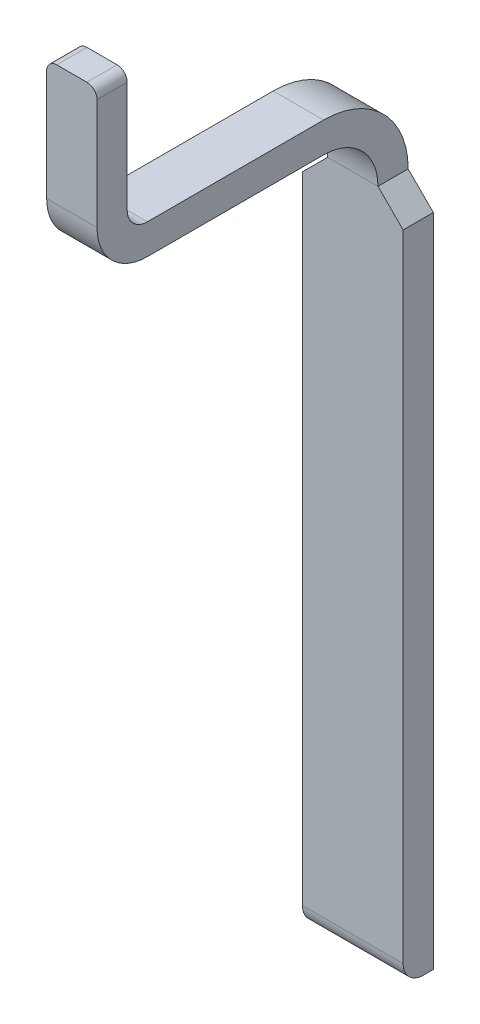
ISO-10303-21;
HEADER;
FILE_DESCRIPTION(('STEP AP214'),'2;1');
FILE_NAME('part.step','',(''),(''),'','','');
FILE_SCHEMA(('AUTOMOTIVE_DESIGN { 1 0 10303 214 1 1 1 1 }'));
ENDSEC;
DATA;
#1=APPLICATION_CONTEXT('core data for automotive mechanical design processes');
#2=APPLICATION_PROTOCOL_DEFINITION('international standard','automotive_design',2000,#1);
#3=PRODUCT_CONTEXT('',#1,'mechanical');
#4=PRODUCT('Part','Part','',(#3));
#5=PRODUCT_RELATED_PRODUCT_CATEGORY('part','',(#4));
#6=PRODUCT_DEFINITION_FORMATION('','',#4);
#7=PRODUCT_DEFINITION_CONTEXT('part definition',#1,'design');
#8=PRODUCT_DEFINITION('design','',#6,#7);
#9=PRODUCT_DEFINITION_SHAPE('','',#8);
#10=(LENGTH_UNIT() NAMED_UNIT(*) SI_UNIT(.MILLI.,.METRE.));
#11=(NAMED_UNIT(*) PLANE_ANGLE_UNIT() SI_UNIT($,.RADIAN.));
#12=(NAMED_UNIT(*) SI_UNIT($,.STERADIAN.) SOLID_ANGLE_UNIT());
#13=UNCERTAINTY_MEASURE_WITH_UNIT(LENGTH_MEASURE(1.E-05),#10,'distance_accuracy_value','');
#14=(GEOMETRIC_REPRESENTATION_CONTEXT(3) GLOBAL_UNCERTAINTY_ASSIGNED_CONTEXT((#13)) GLOBAL_UNIT_ASSIGNED_CONTEXT((#10,
#11,#12)) REPRESENTATION_CONTEXT('',''));
#15=CARTESIAN_POINT('',(0.,0.,0.));
#16=DIRECTION('',(0.,0.,1.));
#17=DIRECTION('',(1.,0.,0.));
#18=AXIS2_PLACEMENT_3D('',#15,#16,#17);
#19=CARTESIAN_POINT('',(1.55,2.03,-0.12));
#20=DIRECTION('',(0.,0.,-1.));
#21=DIRECTION('',(-1.,0.,0.));
#22=AXIS2_PLACEMENT_3D('',#19,#20,#21);
#23=PLANE('',#22);
#24=DIRECTION('',(0.,-1.,0.));
#25=VECTOR('',#24,1.);
#26=CARTESIAN_POINT('',(1.05,2.03,-0.12));
#27=LINE('',#26,#25);
#28=CARTESIAN_POINT('',(1.05,1.905,-0.12));
#29=VERTEX_POINT('',#28);
#30=CARTESIAN_POINT('',(1.05,-1.25,-0.12));
#31=VERTEX_POINT('',#30);
#32=EDGE_CURVE('E10',#29,#31,#27,.T.);
#33=ORIENTED_EDGE('',*,*,#32,.T.);
#34=DIRECTION('',(1.,0.,0.));
#35=VECTOR('',#34,1.);
#36=CARTESIAN_POINT('',(1.55,-1.25,-0.12));
#37=LINE('',#36,#35);
#38=CARTESIAN_POINT('',(1.55,-1.25,-0.12));
#39=VERTEX_POINT('',#38);
#40=EDGE_CURVE('E203',#31,#39,#37,.T.);
#41=ORIENTED_EDGE('',*,*,#40,.T.);
#42=DIRECTION('',(0.,-1.,0.));
#43=VECTOR('',#42,1.);
#44=CARTESIAN_POINT('',(1.55,2.03,-0.12));
#45=LINE('',#44,#43);
#46=CARTESIAN_POINT('',(1.55,1.905,-0.12));
#47=VERTEX_POINT('',#46);
#48=EDGE_CURVE('E26',#47,#39,#45,.T.);
#49=ORIENTED_EDGE('',*,*,#48,.F.);
#50=DIRECTION('',(-0.707106781186547,0.707106781186548,0.));
#51=VECTOR('',#50,1.);
#52=CARTESIAN_POINT('',(1.55,1.905,-0.12));
#53=LINE('',#52,#51);
#54=CARTESIAN_POINT('',(1.425,2.03,-0.12));
#55=VERTEX_POINT('',#54);
#56=EDGE_CURVE('E232',#47,#55,#53,.T.);
#57=ORIENTED_EDGE('',*,*,#56,.T.);
#58=DIRECTION('',(-1.,0.,0.));
#59=VECTOR('',#58,1.);
#60=CARTESIAN_POINT('',(1.55,2.03,-0.12));
#61=LINE('',#60,#59);
#62=CARTESIAN_POINT('',(1.175,2.03,-0.12));
#63=VERTEX_POINT('',#62);
#64=EDGE_CURVE('E292',#55,#63,#61,.T.);
#65=ORIENTED_EDGE('',*,*,#64,.T.);
#66=DIRECTION('',(-0.707106781186547,-0.707106781186548,0.));
#67=VECTOR('',#66,1.);
#68=CARTESIAN_POINT('',(1.175,2.03,-0.12));
#69=LINE('',#68,#67);
#70=EDGE_CURVE('E262',#63,#29,#69,.T.);
#71=ORIENTED_EDGE('',*,*,#70,.T.);
#72=EDGE_LOOP('',(#33,#41,#49,#57,#65,#71));
#73=FACE_BOUND('',#72,.T.);
#74=ADVANCED_FACE('F15',(#73),#23,.F.);
#75=CARTESIAN_POINT('',(1.05,-1.35,-0.27));
#76=DIRECTION('',(1.,0.,0.));
#77=DIRECTION('',(0.,-1.,0.));
#78=AXIS2_PLACEMENT_3D('',#75,#76,#77);
#79=PLANE('',#78);
#80=DIRECTION('',(0.,0.,-1.));
#81=VECTOR('',#80,1.);
#82=CARTESIAN_POINT('',(1.05,-1.35,-0.12));
#83=LINE('',#82,#81);
#84=CARTESIAN_POINT('',(1.05,-1.35,-0.22));
#85=VERTEX_POINT('',#84);
#86=CARTESIAN_POINT('',(1.05,-1.35,-0.27));
#87=VERTEX_POINT('',#86);
#88=EDGE_CURVE('E226',#85,#87,#83,.T.);
#89=ORIENTED_EDGE('',*,*,#88,.F.);
#90=CARTESIAN_POINT('',(1.05,-1.25,-0.22));
#91=DIRECTION('',(-1.,0.,0.));
#92=DIRECTION('',(0.,1.,0.));
#93=AXIS2_PLACEMENT_3D('',#90,#91,#92);
#94=CIRCLE('',#93,0.1);
#95=EDGE_CURVE('E280',#85,#31,#94,.T.);
#96=ORIENTED_EDGE('',*,*,#95,.T.);
#97=ORIENTED_EDGE('',*,*,#32,.F.);
#98=DIRECTION('',(0.,0.,-1.));
#99=VECTOR('',#98,1.);
#100=CARTESIAN_POINT('',(1.05,1.905,-0.27));
#101=LINE('',#100,#99);
#102=CARTESIAN_POINT('',(1.05,1.905,-0.27));
#103=VERTEX_POINT('',#102);
#104=EDGE_CURVE('E259',#29,#103,#101,.T.);
#105=ORIENTED_EDGE('',*,*,#104,.T.);
#106=DIRECTION('',(0.,1.,0.));
#107=VECTOR('',#106,1.);
#108=CARTESIAN_POINT('',(1.05,-1.35,-0.27));
#109=LINE('',#108,#107);
#110=EDGE_CURVE('E225',#87,#103,#109,.T.);
#111=ORIENTED_EDGE('',*,*,#110,.F.);
#112=EDGE_LOOP('',(#89,#96,#97,#105,#111));
#113=FACE_BOUND('',#112,.T.);
#114=ADVANCED_FACE('F357',(#113),#79,.F.);
#115=CARTESIAN_POINT('',(1.55,-1.35,-0.27));
#116=DIRECTION('',(1.,0.,0.));
#117=DIRECTION('',(0.,-1.,0.));
#118=AXIS2_PLACEMENT_3D('',#115,#116,#117);
#119=PLANE('',#118);
#120=ORIENTED_EDGE('',*,*,#48,.T.);
#121=CARTESIAN_POINT('',(1.55,-1.25,-0.22));
#122=DIRECTION('',(1.,0.,0.));
#123=DIRECTION('',(0.,1.,0.));
#124=AXIS2_PLACEMENT_3D('',#121,#122,#123);
#125=CIRCLE('',#124,0.1);
#126=CARTESIAN_POINT('',(1.55,-1.35,-0.22));
#127=VERTEX_POINT('',#126);
#128=EDGE_CURVE('E199',#39,#127,#125,.T.);
#129=ORIENTED_EDGE('',*,*,#128,.T.);
#130=DIRECTION('',(0.,0.,-1.));
#131=VECTOR('',#130,1.);
#132=CARTESIAN_POINT('',(1.55,-1.35,-0.12));
#133=LINE('',#132,#131);
#134=CARTESIAN_POINT('',(1.55,-1.35,-0.27));
#135=VERTEX_POINT('',#134);
#136=EDGE_CURVE('E218',#127,#135,#133,.T.);
#137=ORIENTED_EDGE('',*,*,#136,.T.);
#138=DIRECTION('',(0.,1.,0.));
#139=VECTOR('',#138,1.);
#140=CARTESIAN_POINT('',(1.55,-1.35,-0.27));
#141=LINE('',#140,#139);
#142=CARTESIAN_POINT('',(1.55,1.905,-0.27));
#143=VERTEX_POINT('',#142);
#144=EDGE_CURVE('E263',#135,#143,#141,.T.);
#145=ORIENTED_EDGE('',*,*,#144,.T.);
#146=DIRECTION('',(0.,0.,1.));
#147=VECTOR('',#146,1.);
#148=CARTESIAN_POINT('',(1.55,1.905,-0.12));
#149=LINE('',#148,#147);
#150=EDGE_CURVE('E227',#143,#47,#149,.T.);
#151=ORIENTED_EDGE('',*,*,#150,.T.);
#152=EDGE_LOOP('',(#120,#129,#137,#145,#151));
#153=FACE_BOUND('',#152,.T.);
#154=ADVANCED_FACE('F398',(#153),#119,.T.);
#155=CARTESIAN_POINT('',(1.425,2.03,0.15));
#156=DIRECTION('',(1.,0.,0.));
#157=DIRECTION('',(0.,0.,1.));
#158=AXIS2_PLACEMENT_3D('',#155,#156,#157);
#159=CYLINDRICAL_SURFACE('',#158,0.27);
#160=CARTESIAN_POINT('',(1.175,2.03,0.15));
#161=DIRECTION('',(1.,0.,0.));
#162=DIRECTION('',(0.,-1.,0.));
#163=AXIS2_PLACEMENT_3D('',#160,#161,#162);
#164=CIRCLE('',#163,0.27);
#165=CARTESIAN_POINT('',(1.175,2.3,0.15));
#166=VERTEX_POINT('',#165);
#167=EDGE_CURVE('E209',#63,#166,#164,.T.);
#168=ORIENTED_EDGE('',*,*,#167,.F.);
#169=ORIENTED_EDGE('',*,*,#64,.F.);
#170=CARTESIAN_POINT('',(1.425,2.03,0.15));
#171=DIRECTION('',(1.,0.,0.));
#172=DIRECTION('',(0.,-1.,0.));
#173=AXIS2_PLACEMENT_3D('',#170,#171,#172);
#174=CIRCLE('',#173,0.27);
#175=CARTESIAN_POINT('',(1.425,2.3,0.15));
#176=VERTEX_POINT('',#175);
#177=EDGE_CURVE('E236',#55,#176,#174,.T.);
#178=ORIENTED_EDGE('',*,*,#177,.T.);
#179=DIRECTION('',(-1.,0.,0.));
#180=VECTOR('',#179,1.);
#181=CARTESIAN_POINT('',(1.425,2.3,0.15));
#182=LINE('',#181,#180);
#183=EDGE_CURVE('E295',#176,#166,#182,.T.);
#184=ORIENTED_EDGE('',*,*,#183,.T.);
#185=EDGE_LOOP('',(#168,#169,#178,#184));
#186=FACE_BOUND('',#185,.T.);
#187=ADVANCED_FACE('F418',(#186),#159,.F.);
#188=CARTESIAN_POINT('',(1.425,2.3,0.15));
#189=DIRECTION('',(0.,-1.,0.));
#190=DIRECTION('',(0.,0.,-1.));
#191=AXIS2_PLACEMENT_3D('',#188,#189,#190);
#192=PLANE('',#191);
#193=DIRECTION('',(0.,0.,1.));
#194=VECTOR('',#193,1.);
#195=CARTESIAN_POINT('',(1.175,2.3,0.15));
#196=LINE('',#195,#194);
#197=CARTESIAN_POINT('',(1.175,2.3,1.025));
#198=VERTEX_POINT('',#197);
#199=EDGE_CURVE('E204',#166,#198,#196,.T.);
#200=ORIENTED_EDGE('',*,*,#199,.F.);
#201=ORIENTED_EDGE('',*,*,#183,.F.);
#202=DIRECTION('',(0.,0.,1.));
#203=VECTOR('',#202,1.);
#204=CARTESIAN_POINT('',(1.425,2.3,0.15));
#205=LINE('',#204,#203);
#206=CARTESIAN_POINT('',(1.425,2.3,1.025));
#207=VERTEX_POINT('',#206);
#208=EDGE_CURVE('E233',#176,#207,#205,.T.);
#209=ORIENTED_EDGE('',*,*,#208,.T.);
#210=DIRECTION('',(-1.,0.,0.));
#211=VECTOR('',#210,1.);
#212=CARTESIAN_POINT('',(1.425,2.3,1.025));
#213=LINE('',#212,#211);
#214=EDGE_CURVE('E291',#207,#198,#213,.T.);
#215=ORIENTED_EDGE('',*,*,#214,.T.);
#216=EDGE_LOOP('',(#200,#201,#209,#215));
#217=FACE_BOUND('',#216,.T.);
#218=ADVANCED_FACE('F458',(#217),#192,.T.);
#219=CARTESIAN_POINT('',(1.425,2.55,1.025));
#220=DIRECTION('',(1.,0.,0.));
#221=DIRECTION('',(0.,0.,1.));
#222=AXIS2_PLACEMENT_3D('',#219,#220,#221);
#223=CYLINDRICAL_SURFACE('',#222,0.25);
#224=CARTESIAN_POINT('',(1.175,2.55,1.025));
#225=DIRECTION('',(-1.,0.,0.));
#226=DIRECTION('',(0.,1.,0.));
#227=AXIS2_PLACEMENT_3D('',#224,#225,#226);
#228=CIRCLE('',#227,0.25);
#229=CARTESIAN_POINT('',(1.175,2.55,1.275));
#230=VERTEX_POINT('',#229);
#231=EDGE_CURVE('E208',#198,#230,#228,.T.);
#232=ORIENTED_EDGE('',*,*,#231,.F.);
#233=ORIENTED_EDGE('',*,*,#214,.F.);
#234=CARTESIAN_POINT('',(1.425,2.55,1.025));
#235=DIRECTION('',(-1.,0.,0.));
#236=DIRECTION('',(0.,1.,0.));
#237=AXIS2_PLACEMENT_3D('',#234,#235,#236);
#238=CIRCLE('',#237,0.25);
#239=CARTESIAN_POINT('',(1.425,2.55,1.275));
#240=VERTEX_POINT('',#239);
#241=EDGE_CURVE('E190',#207,#240,#238,.T.);
#242=ORIENTED_EDGE('',*,*,#241,.T.);
#243=DIRECTION('',(-1.,0.,0.));
#244=VECTOR('',#243,1.);
#245=CARTESIAN_POINT('',(1.425,2.55,1.275));
#246=LINE('',#245,#244);
#247=EDGE_CURVE('E213',#240,#230,#246,.T.);
#248=ORIENTED_EDGE('',*,*,#247,.T.);
#249=EDGE_LOOP('',(#232,#233,#242,#248));
#250=FACE_BOUND('',#249,.T.);
#251=ADVANCED_FACE('F455',(#250),#223,.T.);
#252=CARTESIAN_POINT('',(1.425,2.55,1.275));
#253=DIRECTION('',(0.,0.,1.));
#254=DIRECTION('',(0.,-1.,0.));
#255=AXIS2_PLACEMENT_3D('',#252,#253,#254);
#256=PLANE('',#255);
#257=DIRECTION('',(0.,1.,0.));
#258=VECTOR('',#257,1.);
#259=CARTESIAN_POINT('',(1.425,2.55,1.275));
#260=LINE('',#259,#258);
#261=CARTESIAN_POINT('',(1.425,3.1,1.275));
#262=VERTEX_POINT('',#261);
#263=EDGE_CURVE('E184',#240,#262,#260,.T.);
#264=ORIENTED_EDGE('',*,*,#263,.T.);
#265=CARTESIAN_POINT('',(1.375,3.1,1.275));
#266=DIRECTION('',(0.,0.,1.));
#267=DIRECTION('',(0.,-1.,0.));
#268=AXIS2_PLACEMENT_3D('',#265,#266,#267);
#269=CIRCLE('',#268,0.05);
#270=CARTESIAN_POINT('',(1.375,3.15,1.275));
#271=VERTEX_POINT('',#270);
#272=EDGE_CURVE('E285',#262,#271,#269,.T.);
#273=ORIENTED_EDGE('',*,*,#272,.T.);
#274=DIRECTION('',(-1.,0.,0.));
#275=VECTOR('',#274,1.);
#276=CARTESIAN_POINT('',(1.425,3.15,1.275));
#277=LINE('',#276,#275);
#278=CARTESIAN_POINT('',(1.225,3.15,1.275));
#279=VERTEX_POINT('',#278);
#280=EDGE_CURVE('E210',#271,#279,#277,.T.);
#281=ORIENTED_EDGE('',*,*,#280,.T.);
#282=CARTESIAN_POINT('',(1.225,3.1,1.275));
#283=DIRECTION('',(0.,0.,1.));
#284=DIRECTION('',(0.,-1.,0.));
#285=AXIS2_PLACEMENT_3D('',#282,#283,#284);
#286=CIRCLE('',#285,0.05);
#287=CARTESIAN_POINT('',(1.175,3.1,1.275));
#288=VERTEX_POINT('',#287);
#289=EDGE_CURVE('E231',#279,#288,#286,.T.);
#290=ORIENTED_EDGE('',*,*,#289,.T.);
#291=DIRECTION('',(0.,1.,0.));
#292=VECTOR('',#291,1.);
#293=CARTESIAN_POINT('',(1.175,2.55,1.275));
#294=LINE('',#293,#292);
#295=EDGE_CURVE('E243',#230,#288,#294,.T.);
#296=ORIENTED_EDGE('',*,*,#295,.F.);
#297=ORIENTED_EDGE('',*,*,#247,.F.);
#298=EDGE_LOOP('',(#264,#273,#281,#290,#296,#297));
#299=FACE_BOUND('',#298,.T.);
#300=ADVANCED_FACE('F379',(#299),#256,.T.);
#301=CARTESIAN_POINT('',(1.425,3.15,1.275));
#302=DIRECTION('',(0.,1.,0.));
#303=DIRECTION('',(1.,0.,0.));
#304=AXIS2_PLACEMENT_3D('',#301,#302,#303);
#305=PLANE('',#304);
#306=ORIENTED_EDGE('',*,*,#280,.F.);
#307=DIRECTION('',(0.,0.,-1.));
#308=VECTOR('',#307,1.);
#309=CARTESIAN_POINT('',(1.375,3.15,1.275));
#310=LINE('',#309,#308);
#311=CARTESIAN_POINT('',(1.375,3.15,1.125));
#312=VERTEX_POINT('',#311);
#313=EDGE_CURVE('E214',#271,#312,#310,.T.);
#314=ORIENTED_EDGE('',*,*,#313,.T.);
#315=DIRECTION('',(-1.,0.,0.));
#316=VECTOR('',#315,1.);
#317=CARTESIAN_POINT('',(1.425,3.15,1.125));
#318=LINE('',#317,#316);
#319=CARTESIAN_POINT('',(1.225,3.15,1.125));
#320=VERTEX_POINT('',#319);
#321=EDGE_CURVE('E165',#312,#320,#318,.T.);
#322=ORIENTED_EDGE('',*,*,#321,.T.);
#323=DIRECTION('',(0.,0.,1.));
#324=VECTOR('',#323,1.);
#325=CARTESIAN_POINT('',(1.225,3.15,1.275));
#326=LINE('',#325,#324);
#327=EDGE_CURVE('E19',#320,#279,#326,.T.);
#328=ORIENTED_EDGE('',*,*,#327,.T.);
#329=EDGE_LOOP('',(#306,#314,#322,#328));
#330=FACE_BOUND('',#329,.T.);
#331=ADVANCED_FACE('F445',(#330),#305,.T.);
#332=CARTESIAN_POINT('',(1.425,2.55,1.125));
#333=DIRECTION('',(0.,0.,-1.));
#334=DIRECTION('',(0.,-1.,0.));
#335=AXIS2_PLACEMENT_3D('',#332,#333,#334);
#336=PLANE('',#335);
#337=ORIENTED_EDGE('',*,*,#321,.F.);
#338=CARTESIAN_POINT('',(1.375,3.1,1.125));
#339=DIRECTION('',(0.,0.,-1.));
#340=DIRECTION('',(0.,1.,0.));
#341=AXIS2_PLACEMENT_3D('',#338,#339,#340);
#342=CIRCLE('',#341,0.05);
#343=CARTESIAN_POINT('',(1.425,3.1,1.125));
#344=VERTEX_POINT('',#343);
#345=EDGE_CURVE('E181',#312,#344,#342,.T.);
#346=ORIENTED_EDGE('',*,*,#345,.T.);
#347=DIRECTION('',(0.,-1.,0.));
#348=VECTOR('',#347,1.);
#349=CARTESIAN_POINT('',(1.425,2.55,1.125));
#350=LINE('',#349,#348);
#351=CARTESIAN_POINT('',(1.425,2.55,1.125));
#352=VERTEX_POINT('',#351);
#353=EDGE_CURVE('E172',#344,#352,#350,.T.);
#354=ORIENTED_EDGE('',*,*,#353,.T.);
#355=DIRECTION('',(-1.,0.,0.));
#356=VECTOR('',#355,1.);
#357=CARTESIAN_POINT('',(1.425,2.55,1.125));
#358=LINE('',#357,#356);
#359=CARTESIAN_POINT('',(1.175,2.55,1.125));
#360=VERTEX_POINT('',#359);
#361=EDGE_CURVE('E154',#352,#360,#358,.T.);
#362=ORIENTED_EDGE('',*,*,#361,.T.);
#363=DIRECTION('',(0.,-1.,0.));
#364=VECTOR('',#363,1.);
#365=CARTESIAN_POINT('',(1.175,2.55,1.125));
#366=LINE('',#365,#364);
#367=CARTESIAN_POINT('',(1.175,3.1,1.125));
#368=VERTEX_POINT('',#367);
#369=EDGE_CURVE('E196',#368,#360,#366,.T.);
#370=ORIENTED_EDGE('',*,*,#369,.F.);
#371=CARTESIAN_POINT('',(1.225,3.1,1.125));
#372=DIRECTION('',(0.,0.,-1.));
#373=DIRECTION('',(0.,1.,0.));
#374=AXIS2_PLACEMENT_3D('',#371,#372,#373);
#375=CIRCLE('',#374,0.05);
#376=EDGE_CURVE('E253',#368,#320,#375,.T.);
#377=ORIENTED_EDGE('',*,*,#376,.T.);
#378=EDGE_LOOP('',(#337,#346,#354,#362,#370,#377));
#379=FACE_BOUND('',#378,.T.);
#380=ADVANCED_FACE('F179',(#379),#336,.T.);
#381=CARTESIAN_POINT('',(1.425,2.55,1.025));
#382=DIRECTION('',(1.,0.,0.));
#383=DIRECTION('',(0.,0.,1.));
#384=AXIS2_PLACEMENT_3D('',#381,#382,#383);
#385=CYLINDRICAL_SURFACE('',#384,0.1);
#386=CARTESIAN_POINT('',(1.175,2.55,1.025));
#387=DIRECTION('',(1.,0.,0.));
#388=DIRECTION('',(0.,1.,0.));
#389=AXIS2_PLACEMENT_3D('',#386,#387,#388);
#390=CIRCLE('',#389,0.1);
#391=CARTESIAN_POINT('',(1.175,2.45,1.025));
#392=VERTEX_POINT('',#391);
#393=EDGE_CURVE('E160',#360,#392,#390,.T.);
#394=ORIENTED_EDGE('',*,*,#393,.F.);
#395=ORIENTED_EDGE('',*,*,#361,.F.);
#396=CARTESIAN_POINT('',(1.425,2.55,1.025));
#397=DIRECTION('',(1.,0.,0.));
#398=DIRECTION('',(0.,1.,0.));
#399=AXIS2_PLACEMENT_3D('',#396,#397,#398);
#400=CIRCLE('',#399,0.1);
#401=CARTESIAN_POINT('',(1.425,2.45,1.025));
#402=VERTEX_POINT('',#401);
#403=EDGE_CURVE('E157',#352,#402,#400,.T.);
#404=ORIENTED_EDGE('',*,*,#403,.T.);
#405=DIRECTION('',(-1.,0.,0.));
#406=VECTOR('',#405,1.);
#407=CARTESIAN_POINT('',(1.425,2.45,1.025));
#408=LINE('',#407,#406);
#409=EDGE_CURVE('E40',#402,#392,#408,.T.);
#410=ORIENTED_EDGE('',*,*,#409,.T.);
#411=EDGE_LOOP('',(#394,#395,#404,#410));
#412=FACE_BOUND('',#411,.T.);
#413=ADVANCED_FACE('F156',(#412),#385,.F.);
#414=CARTESIAN_POINT('',(1.425,2.45,0.15));
#415=DIRECTION('',(0.,1.,0.));
#416=DIRECTION('',(1.,0.,0.));
#417=AXIS2_PLACEMENT_3D('',#414,#415,#416);
#418=PLANE('',#417);
#419=DIRECTION('',(0.,0.,-1.));
#420=VECTOR('',#419,1.);
#421=CARTESIAN_POINT('',(1.175,2.45,0.15));
#422=LINE('',#421,#420);
#423=CARTESIAN_POINT('',(1.175,2.45,0.15));
#424=VERTEX_POINT('',#423);
#425=EDGE_CURVE('E254',#392,#424,#422,.T.);
#426=ORIENTED_EDGE('',*,*,#425,.F.);
#427=ORIENTED_EDGE('',*,*,#409,.F.);
#428=DIRECTION('',(0.,0.,-1.));
#429=VECTOR('',#428,1.);
#430=CARTESIAN_POINT('',(1.425,2.45,0.15));
#431=LINE('',#430,#429);
#432=CARTESIAN_POINT('',(1.425,2.45,0.15));
#433=VERTEX_POINT('',#432);
#434=EDGE_CURVE('E175',#402,#433,#431,.T.);
#435=ORIENTED_EDGE('',*,*,#434,.T.);
#436=DIRECTION('',(-1.,0.,0.));
#437=VECTOR('',#436,1.);
#438=CARTESIAN_POINT('',(1.425,2.45,0.15));
#439=LINE('',#438,#437);
#440=EDGE_CURVE('E193',#433,#424,#439,.T.);
#441=ORIENTED_EDGE('',*,*,#440,.T.);
#442=EDGE_LOOP('',(#426,#427,#435,#441));
#443=FACE_BOUND('',#442,.T.);
#444=ADVANCED_FACE('F422',(#443),#418,.T.);
#445=CARTESIAN_POINT('',(1.425,2.03,0.15));
#446=DIRECTION('',(1.,0.,0.));
#447=DIRECTION('',(0.,-1.,0.));
#448=AXIS2_PLACEMENT_3D('',#445,#446,#447);
#449=PLANE('',#448);
#450=ORIENTED_EDGE('',*,*,#353,.F.);
#451=DIRECTION('',(0.,0.,1.));
#452=VECTOR('',#451,1.);
#453=CARTESIAN_POINT('',(1.425,3.1,0.15));
#454=LINE('',#453,#452);
#455=EDGE_CURVE('E242',#344,#262,#454,.T.);
#456=ORIENTED_EDGE('',*,*,#455,.T.);
#457=ORIENTED_EDGE('',*,*,#263,.F.);
#458=ORIENTED_EDGE('',*,*,#241,.F.);
#459=ORIENTED_EDGE('',*,*,#208,.F.);
#460=ORIENTED_EDGE('',*,*,#177,.F.);
#461=DIRECTION('',(0.,0.,-1.));
#462=VECTOR('',#461,1.);
#463=CARTESIAN_POINT('',(1.425,2.03,-0.27));
#464=LINE('',#463,#462);
#465=CARTESIAN_POINT('',(1.425,2.03,-0.27));
#466=VERTEX_POINT('',#465);
#467=EDGE_CURVE('E319',#55,#466,#464,.T.);
#468=ORIENTED_EDGE('',*,*,#467,.T.);
#469=CARTESIAN_POINT('',(1.425,2.03,0.15));
#470=DIRECTION('',(-1.,0.,0.));
#471=DIRECTION('',(0.,-1.,0.));
#472=AXIS2_PLACEMENT_3D('',#469,#470,#471);
#473=CIRCLE('',#472,0.42);
#474=EDGE_CURVE('E185',#433,#466,#473,.T.);
#475=ORIENTED_EDGE('',*,*,#474,.F.);
#476=ORIENTED_EDGE('',*,*,#434,.F.);
#477=ORIENTED_EDGE('',*,*,#403,.F.);
#478=EDGE_LOOP('',(#450,#456,#457,#458,#459,#460,#468,#475,#476,#477));
#479=FACE_BOUND('',#478,.T.);
#480=ADVANCED_FACE('F169',(#479),#449,.T.);
#481=CARTESIAN_POINT('',(1.425,2.03,0.15));
#482=DIRECTION('',(1.,0.,0.));
#483=DIRECTION('',(0.,0.,1.));
#484=AXIS2_PLACEMENT_3D('',#481,#482,#483);
#485=CYLINDRICAL_SURFACE('',#484,0.42);
#486=CARTESIAN_POINT('',(1.175,2.03,0.15));
#487=DIRECTION('',(-1.,0.,0.));
#488=DIRECTION('',(0.,-1.,0.));
#489=AXIS2_PLACEMENT_3D('',#486,#487,#488);
#490=CIRCLE('',#489,0.42);
#491=CARTESIAN_POINT('',(1.175,2.03,-0.27));
#492=VERTEX_POINT('',#491);
#493=EDGE_CURVE('E258',#424,#492,#490,.T.);
#494=ORIENTED_EDGE('',*,*,#493,.F.);
#495=ORIENTED_EDGE('',*,*,#440,.F.);
#496=ORIENTED_EDGE('',*,*,#474,.T.);
#497=DIRECTION('',(-1.,0.,0.));
#498=VECTOR('',#497,1.);
#499=CARTESIAN_POINT('',(1.55,2.03,-0.27));
#500=LINE('',#499,#498);
#501=EDGE_CURVE('E279',#466,#492,#500,.T.);
#502=ORIENTED_EDGE('',*,*,#501,.T.);
#503=EDGE_LOOP('',(#494,#495,#496,#502));
#504=FACE_BOUND('',#503,.T.);
#505=ADVANCED_FACE('F409',(#504),#485,.T.);
#506=CARTESIAN_POINT('',(1.175,2.03,0.15));
#507=DIRECTION('',(1.,0.,0.));
#508=DIRECTION('',(0.,-1.,0.));
#509=AXIS2_PLACEMENT_3D('',#506,#507,#508);
#510=PLANE('',#509);
#511=ORIENTED_EDGE('',*,*,#295,.T.);
#512=DIRECTION('',(0.,0.,-1.));
#513=VECTOR('',#512,1.);
#514=CARTESIAN_POINT('',(1.175,3.1,1.125));
#515=LINE('',#514,#513);
#516=EDGE_CURVE('E246',#288,#368,#515,.T.);
#517=ORIENTED_EDGE('',*,*,#516,.T.);
#518=ORIENTED_EDGE('',*,*,#369,.T.);
#519=ORIENTED_EDGE('',*,*,#393,.T.);
#520=ORIENTED_EDGE('',*,*,#425,.T.);
#521=ORIENTED_EDGE('',*,*,#493,.T.);
#522=DIRECTION('',(0.,0.,1.));
#523=VECTOR('',#522,1.);
#524=CARTESIAN_POINT('',(1.175,2.03,-0.27));
#525=LINE('',#524,#523);
#526=EDGE_CURVE('E272',#492,#63,#525,.T.);
#527=ORIENTED_EDGE('',*,*,#526,.T.);
#528=ORIENTED_EDGE('',*,*,#167,.T.);
#529=ORIENTED_EDGE('',*,*,#199,.T.);
#530=ORIENTED_EDGE('',*,*,#231,.T.);
#531=EDGE_LOOP('',(#511,#517,#518,#519,#520,#521,#527,#528,#529,#530));
#532=FACE_BOUND('',#531,.T.);
#533=ADVANCED_FACE('F421',(#532),#510,.F.);
#534=CARTESIAN_POINT('',(1.225,3.1,0.15));
#535=DIRECTION('',(0.,0.,-1.));
#536=DIRECTION('',(1.,0.,0.));
#537=AXIS2_PLACEMENT_3D('',#534,#535,#536);
#538=CYLINDRICAL_SURFACE('',#537,0.05);
#539=ORIENTED_EDGE('',*,*,#289,.F.);
#540=ORIENTED_EDGE('',*,*,#327,.F.);
#541=ORIENTED_EDGE('',*,*,#376,.F.);
#542=ORIENTED_EDGE('',*,*,#516,.F.);
#543=EDGE_LOOP('',(#539,#540,#541,#542));
#544=FACE_BOUND('',#543,.T.);
#545=ADVANCED_FACE('F442',(#544),#538,.T.);
#546=CARTESIAN_POINT('',(1.55,1.905,-0.27));
#547=DIRECTION('',(0.707106781186548,0.707106781186547,0.));
#548=DIRECTION('',(0.,0.,-1.));
#549=AXIS2_PLACEMENT_3D('',#546,#547,#548);
#550=PLANE('',#549);
#551=DIRECTION('',(0.707106781186547,-0.707106781186548,0.));
#552=VECTOR('',#551,1.);
#553=CARTESIAN_POINT('',(1.55,1.905,-0.27));
#554=LINE('',#553,#552);
#555=EDGE_CURVE('E275',#466,#143,#554,.T.);
#556=ORIENTED_EDGE('',*,*,#555,.F.);
#557=ORIENTED_EDGE('',*,*,#467,.F.);
#558=ORIENTED_EDGE('',*,*,#56,.F.);
#559=ORIENTED_EDGE('',*,*,#150,.F.);
#560=EDGE_LOOP('',(#556,#557,#558,#559));
#561=FACE_BOUND('',#560,.T.);
#562=ADVANCED_FACE('F415',(#561),#550,.T.);
#563=CARTESIAN_POINT('',(1.175,2.03,-0.27));
#564=DIRECTION('',(0.707106781186548,-0.707106781186547,0.));
#565=DIRECTION('',(0.,0.,-1.));
#566=AXIS2_PLACEMENT_3D('',#563,#564,#565);
#567=PLANE('',#566);
#568=DIRECTION('',(0.707106781186547,0.707106781186548,0.));
#569=VECTOR('',#568,1.);
#570=CARTESIAN_POINT('',(1.175,2.03,-0.27));
#571=LINE('',#570,#569);
#572=EDGE_CURVE('E324',#103,#492,#571,.T.);
#573=ORIENTED_EDGE('',*,*,#572,.F.);
#574=ORIENTED_EDGE('',*,*,#104,.F.);
#575=ORIENTED_EDGE('',*,*,#70,.F.);
#576=ORIENTED_EDGE('',*,*,#526,.F.);
#577=EDGE_LOOP('',(#573,#574,#575,#576));
#578=FACE_BOUND('',#577,.T.);
#579=ADVANCED_FACE('F406',(#578),#567,.F.);
#580=CARTESIAN_POINT('',(1.55,-1.35,-0.27));
#581=DIRECTION('',(0.,0.,1.));
#582=DIRECTION('',(0.,-1.,0.));
#583=AXIS2_PLACEMENT_3D('',#580,#581,#582);
#584=PLANE('',#583);
#585=ORIENTED_EDGE('',*,*,#110,.T.);
#586=ORIENTED_EDGE('',*,*,#572,.T.);
#587=ORIENTED_EDGE('',*,*,#501,.F.);
#588=ORIENTED_EDGE('',*,*,#555,.T.);
#589=ORIENTED_EDGE('',*,*,#144,.F.);
#590=DIRECTION('',(-1.,0.,0.));
#591=VECTOR('',#590,1.);
#592=CARTESIAN_POINT('',(1.55,-1.35,-0.27));
#593=LINE('',#592,#591);
#594=EDGE_CURVE('E221',#135,#87,#593,.T.);
#595=ORIENTED_EDGE('',*,*,#594,.T.);
#596=EDGE_LOOP('',(#585,#586,#587,#588,#589,#595));
#597=FACE_BOUND('',#596,.T.);
#598=ADVANCED_FACE('F362',(#597),#584,.F.);
#599=CARTESIAN_POINT('',(1.55,-1.35,-0.12));
#600=DIRECTION('',(0.,1.,0.));
#601=DIRECTION('',(1.,0.,0.));
#602=AXIS2_PLACEMENT_3D('',#599,#600,#601);
#603=PLANE('',#602);
#604=ORIENTED_EDGE('',*,*,#136,.F.);
#605=DIRECTION('',(-1.,0.,0.));
#606=VECTOR('',#605,1.);
#607=CARTESIAN_POINT('',(1.55,-1.35,-0.22));
#608=LINE('',#607,#606);
#609=EDGE_CURVE('E284',#127,#85,#608,.T.);
#610=ORIENTED_EDGE('',*,*,#609,.T.);
#611=ORIENTED_EDGE('',*,*,#88,.T.);
#612=ORIENTED_EDGE('',*,*,#594,.F.);
#613=EDGE_LOOP('',(#604,#610,#611,#612));
#614=FACE_BOUND('',#613,.T.);
#615=ADVANCED_FACE('F353',(#614),#603,.F.);
#616=CARTESIAN_POINT('',(1.375,3.1,1.275));
#617=DIRECTION('',(0.,0.,1.));
#618=DIRECTION('',(-1.,0.,0.));
#619=AXIS2_PLACEMENT_3D('',#616,#617,#618);
#620=CYLINDRICAL_SURFACE('',#619,0.05);
#621=ORIENTED_EDGE('',*,*,#272,.F.);
#622=ORIENTED_EDGE('',*,*,#455,.F.);
#623=ORIENTED_EDGE('',*,*,#345,.F.);
#624=ORIENTED_EDGE('',*,*,#313,.F.);
#625=EDGE_LOOP('',(#621,#622,#623,#624));
#626=FACE_BOUND('',#625,.T.);
#627=ADVANCED_FACE('F377',(#626),#620,.T.);
#628=CARTESIAN_POINT('',(1.55,-1.25,-0.22));
#629=DIRECTION('',(1.,0.,0.));
#630=DIRECTION('',(0.,0.,1.));
#631=AXIS2_PLACEMENT_3D('',#628,#629,#630);
#632=CYLINDRICAL_SURFACE('',#631,0.1);
#633=ORIENTED_EDGE('',*,*,#128,.F.);
#634=ORIENTED_EDGE('',*,*,#40,.F.);
#635=ORIENTED_EDGE('',*,*,#95,.F.);
#636=ORIENTED_EDGE('',*,*,#609,.F.);
#637=EDGE_LOOP('',(#633,#634,#635,#636));
#638=FACE_BOUND('',#637,.T.);
#639=ADVANCED_FACE('F17',(#638),#632,.T.);
#640=CLOSED_SHELL('',(#74,#114,#154,#187,#218,#251,#300,#331,#380,#413,#444,#480,#505,#533,#545,
#562,#579,#598,#615,#627,#639));
#641=MANIFOLD_SOLID_BREP('B1',#640);
#642=ADVANCED_BREP_SHAPE_REPRESENTATION('',(#18,#641),#14);
#643=SHAPE_DEFINITION_REPRESENTATION(#9,#642);
ENDSEC;
END-ISO-10303-21;
